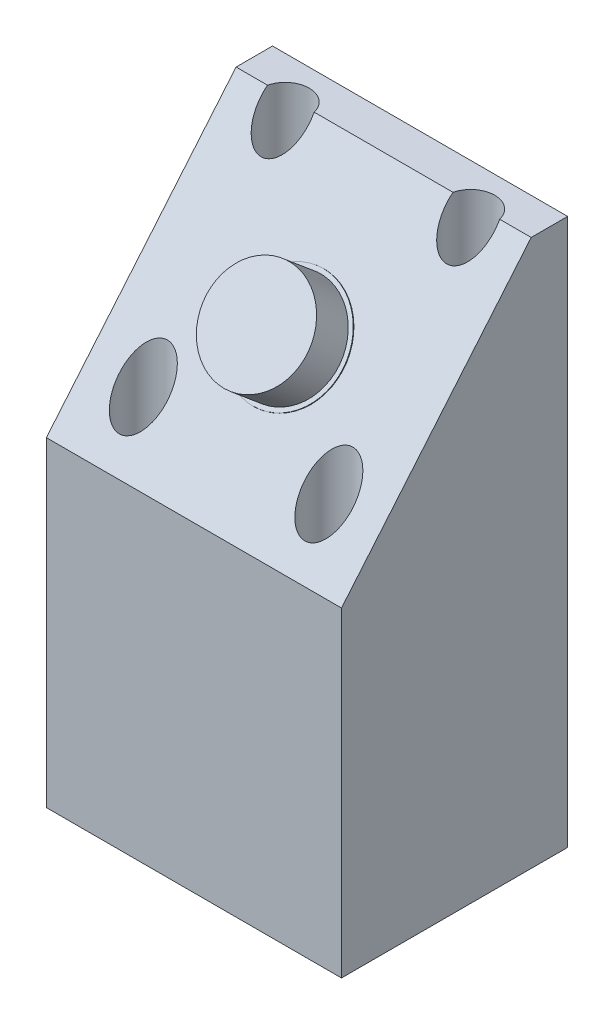
ISO-10303-21;
HEADER;
FILE_DESCRIPTION(('STEP AP214'),'2;1');
FILE_NAME('part.step','',(''),(''),'','','');
FILE_SCHEMA(('AUTOMOTIVE_DESIGN { 1 0 10303 214 1 1 1 1 }'));
ENDSEC;
DATA;
#1=APPLICATION_CONTEXT('core data for automotive mechanical design processes');
#2=APPLICATION_PROTOCOL_DEFINITION('international standard','automotive_design',2000,#1);
#3=PRODUCT_CONTEXT('',#1,'mechanical');
#4=PRODUCT('Part','Part','',(#3));
#5=PRODUCT_RELATED_PRODUCT_CATEGORY('part','',(#4));
#6=PRODUCT_DEFINITION_FORMATION('','',#4);
#7=PRODUCT_DEFINITION_CONTEXT('part definition',#1,'design');
#8=PRODUCT_DEFINITION('design','',#6,#7);
#9=PRODUCT_DEFINITION_SHAPE('','',#8);
#10=(LENGTH_UNIT() NAMED_UNIT(*) SI_UNIT(.MILLI.,.METRE.));
#11=(NAMED_UNIT(*) PLANE_ANGLE_UNIT() SI_UNIT($,.RADIAN.));
#12=(NAMED_UNIT(*) SI_UNIT($,.STERADIAN.) SOLID_ANGLE_UNIT());
#13=UNCERTAINTY_MEASURE_WITH_UNIT(LENGTH_MEASURE(1.E-05),#10,'distance_accuracy_value','');
#14=(GEOMETRIC_REPRESENTATION_CONTEXT(3) GLOBAL_UNCERTAINTY_ASSIGNED_CONTEXT((#13)) GLOBAL_UNIT_ASSIGNED_CONTEXT((#10,
#11,#12)) REPRESENTATION_CONTEXT('',''));
#15=CARTESIAN_POINT('',(0.,0.,0.));
#16=DIRECTION('',(0.,0.,1.));
#17=DIRECTION('',(1.,0.,0.));
#18=AXIS2_PLACEMENT_3D('',#15,#16,#17);
#19=CARTESIAN_POINT('',(35.,0.,0.));
#20=DIRECTION('',(0.,0.,-1.));
#21=DIRECTION('',(-1.,0.,0.));
#22=AXIS2_PLACEMENT_3D('',#19,#20,#21);
#23=PLANE('',#22);
#24=DIRECTION('',(0.,-1.,0.));
#25=VECTOR('',#24,1.);
#26=CARTESIAN_POINT('',(0.,0.,0.));
#27=LINE('',#26,#25);
#28=CARTESIAN_POINT('',(0.,38.,0.));
#29=VERTEX_POINT('',#28);
#30=CARTESIAN_POINT('',(0.,0.,0.));
#31=VERTEX_POINT('',#30);
#32=EDGE_CURVE('E137',#29,#31,#27,.T.);
#33=ORIENTED_EDGE('',*,*,#32,.T.);
#34=DIRECTION('',(-1.,0.,0.));
#35=VECTOR('',#34,1.);
#36=CARTESIAN_POINT('',(35.,0.,0.));
#37=LINE('',#36,#35);
#38=CARTESIAN_POINT('',(35.,0.,0.));
#39=VERTEX_POINT('',#38);
#40=EDGE_CURVE('E217',#39,#31,#37,.T.);
#41=ORIENTED_EDGE('',*,*,#40,.F.);
#42=DIRECTION('',(0.,-1.,0.));
#43=VECTOR('',#42,1.);
#44=CARTESIAN_POINT('',(35.,0.,0.));
#45=LINE('',#44,#43);
#46=CARTESIAN_POINT('',(35.,38.,0.));
#47=VERTEX_POINT('',#46);
#48=EDGE_CURVE('E130',#47,#39,#45,.T.);
#49=ORIENTED_EDGE('',*,*,#48,.F.);
#50=DIRECTION('',(-1.,0.,0.));
#51=VECTOR('',#50,1.);
#52=CARTESIAN_POINT('',(35.,38.,0.));
#53=LINE('',#52,#51);
#54=EDGE_CURVE('E118',#47,#29,#53,.T.);
#55=ORIENTED_EDGE('',*,*,#54,.T.);
#56=EDGE_LOOP('',(#33,#41,#49,#55));
#57=FACE_BOUND('',#56,.T.);
#58=ADVANCED_FACE('F35',(#57),#23,.F.);
#59=CARTESIAN_POINT('',(35.,0.,-22.4975663390288));
#60=DIRECTION('',(0.,1.,0.));
#61=DIRECTION('',(0.,0.,1.));
#62=AXIS2_PLACEMENT_3D('',#59,#60,#61);
#63=PLANE('',#62);
#64=CARTESIAN_POINT('',(6.49999999999999,0.,-5.));
#65=DIRECTION('',(0.,1.,0.));
#66=DIRECTION('',(0.,0.,1.));
#67=AXIS2_PLACEMENT_3D('',#64,#65,#66);
#68=CIRCLE('',#67,1.7);
#69=CARTESIAN_POINT('',(6.49999999999999,0.,-3.30000000000001));
#70=VERTEX_POINT('',#69);
#71=EDGE_CURVE('E183',#70,#70,#68,.T.);
#72=ORIENTED_EDGE('',*,*,#71,.T.);
#73=EDGE_LOOP('',(#72));
#74=FACE_BOUND('',#73,.T.);
#75=CARTESIAN_POINT('',(6.49999999999999,0.,-21.82));
#76=DIRECTION('',(0.,1.,0.));
#77=DIRECTION('',(0.,0.,1.));
#78=AXIS2_PLACEMENT_3D('',#75,#76,#77);
#79=CIRCLE('',#78,1.7);
#80=CARTESIAN_POINT('',(6.49999999999999,0.,-20.12));
#81=VERTEX_POINT('',#80);
#82=EDGE_CURVE('E177',#81,#81,#79,.T.);
#83=ORIENTED_EDGE('',*,*,#82,.T.);
#84=EDGE_LOOP('',(#83));
#85=FACE_BOUND('',#84,.T.);
#86=CARTESIAN_POINT('',(28.5,0.,-21.82));
#87=DIRECTION('',(0.,1.,0.));
#88=DIRECTION('',(0.,0.,1.));
#89=AXIS2_PLACEMENT_3D('',#86,#87,#88);
#90=CIRCLE('',#89,1.7);
#91=CARTESIAN_POINT('',(28.5,0.,-20.12));
#92=VERTEX_POINT('',#91);
#93=EDGE_CURVE('E171',#92,#92,#90,.T.);
#94=ORIENTED_EDGE('',*,*,#93,.T.);
#95=EDGE_LOOP('',(#94));
#96=FACE_BOUND('',#95,.T.);
#97=CARTESIAN_POINT('',(28.5,0.,-5.));
#98=DIRECTION('',(0.,1.,0.));
#99=DIRECTION('',(0.,0.,1.));
#100=AXIS2_PLACEMENT_3D('',#97,#98,#99);
#101=CIRCLE('',#100,1.7);
#102=CARTESIAN_POINT('',(28.5,0.,-3.3));
#103=VERTEX_POINT('',#102);
#104=EDGE_CURVE('E158',#103,#103,#101,.T.);
#105=ORIENTED_EDGE('',*,*,#104,.T.);
#106=EDGE_LOOP('',(#105));
#107=FACE_BOUND('',#106,.T.);
#108=DIRECTION('',(0.,0.,-1.));
#109=VECTOR('',#108,1.);
#110=CARTESIAN_POINT('',(0.,0.,-22.4975663390288));
#111=LINE('',#110,#109);
#112=CARTESIAN_POINT('',(0.,0.,-26.82));
#113=VERTEX_POINT('',#112);
#114=EDGE_CURVE('E135',#31,#113,#111,.T.);
#115=ORIENTED_EDGE('',*,*,#114,.T.);
#116=DIRECTION('',(-1.,0.,0.));
#117=VECTOR('',#116,1.);
#118=CARTESIAN_POINT('',(35.,0.,-26.82));
#119=LINE('',#118,#117);
#120=CARTESIAN_POINT('',(35.,0.,-26.82));
#121=VERTEX_POINT('',#120);
#122=EDGE_CURVE('E115',#121,#113,#119,.T.);
#123=ORIENTED_EDGE('',*,*,#122,.F.);
#124=DIRECTION('',(0.,0.,-1.));
#125=VECTOR('',#124,1.);
#126=CARTESIAN_POINT('',(35.,0.,0.));
#127=LINE('',#126,#125);
#128=EDGE_CURVE('E143',#39,#121,#127,.T.);
#129=ORIENTED_EDGE('',*,*,#128,.F.);
#130=ORIENTED_EDGE('',*,*,#40,.T.);
#131=EDGE_LOOP('',(#115,#123,#129,#130));
#132=FACE_BOUND('',#131,.T.);
#133=ADVANCED_FACE('F239',(#74,#85,#96,#107,#132),#63,.F.);
#134=CARTESIAN_POINT('',(35.,0.,-26.82));
#135=DIRECTION('',(0.,0.,1.));
#136=DIRECTION('',(1.,0.,0.));
#137=AXIS2_PLACEMENT_3D('',#134,#135,#136);
#138=PLANE('',#137);
#139=DIRECTION('',(0.,1.,0.));
#140=VECTOR('',#139,1.);
#141=CARTESIAN_POINT('',(0.,0.,-26.82));
#142=LINE('',#141,#140);
#143=CARTESIAN_POINT('',(0.,64.8115555091643,-26.82));
#144=VERTEX_POINT('',#143);
#145=EDGE_CURVE('E133',#113,#144,#142,.T.);
#146=ORIENTED_EDGE('',*,*,#145,.T.);
#147=DIRECTION('',(-1.,0.,0.));
#148=VECTOR('',#147,1.);
#149=CARTESIAN_POINT('',(35.,64.8115555091643,-26.82));
#150=LINE('',#149,#148);
#151=CARTESIAN_POINT('',(35.,64.8115555091643,-26.82));
#152=VERTEX_POINT('',#151);
#153=EDGE_CURVE('E111',#152,#144,#150,.T.);
#154=ORIENTED_EDGE('',*,*,#153,.F.);
#155=DIRECTION('',(0.,1.,0.));
#156=VECTOR('',#155,1.);
#157=CARTESIAN_POINT('',(35.,0.,-26.82));
#158=LINE('',#157,#156);
#159=EDGE_CURVE('E141',#121,#152,#158,.T.);
#160=ORIENTED_EDGE('',*,*,#159,.F.);
#161=ORIENTED_EDGE('',*,*,#122,.T.);
#162=EDGE_LOOP('',(#146,#154,#160,#161));
#163=FACE_BOUND('',#162,.T.);
#164=ADVANCED_FACE('F230',(#163),#138,.F.);
#165=CARTESIAN_POINT('',(35.,64.8115555091643,-26.82));
#166=DIRECTION('',(0.,-1.,0.));
#167=DIRECTION('',(0.,0.,-1.));
#168=AXIS2_PLACEMENT_3D('',#165,#166,#167);
#169=PLANE('',#168);
#170=DIRECTION('',(-1.,0.,0.));
#171=VECTOR('',#170,1.);
#172=CARTESIAN_POINT('',(35.,64.8115555091643,-22.4975663390288));
#173=LINE('',#172,#171);
#174=CARTESIAN_POINT('',(3.73171463605806,64.8115555091643,-22.4975663390288));
#175=VERTEX_POINT('',#174);
#176=CARTESIAN_POINT('',(0.,64.8115555091643,-22.4975663390288));
#177=VERTEX_POINT('',#176);
#178=EDGE_CURVE('E113',#175,#177,#173,.T.);
#179=ORIENTED_EDGE('',*,*,#178,.F.);
#180=CARTESIAN_POINT('',(6.49999999999999,64.8115555091643,-21.82));
#181=DIRECTION('',(0.,-1.,0.));
#182=DIRECTION('',(0.,0.,-1.));
#183=AXIS2_PLACEMENT_3D('',#180,#181,#182);
#184=CIRCLE('',#183,2.85);
#185=CARTESIAN_POINT('',(9.26828536394192,64.8115555091643,-22.4975663390288));
#186=VERTEX_POINT('',#185);
#187=EDGE_CURVE('E49',#175,#186,#184,.T.);
#188=ORIENTED_EDGE('',*,*,#187,.T.);
#189=CARTESIAN_POINT('',(25.7317146360581,64.8115555091643,-22.4975663390288));
#190=VERTEX_POINT('',#189);
#191=EDGE_CURVE('E104',#190,#186,#173,.T.);
#192=ORIENTED_EDGE('',*,*,#191,.F.);
#193=CARTESIAN_POINT('',(28.5,64.8115555091643,-21.82));
#194=DIRECTION('',(0.,-1.,0.));
#195=DIRECTION('',(0.,0.,1.));
#196=AXIS2_PLACEMENT_3D('',#193,#194,#195);
#197=CIRCLE('',#196,2.85);
#198=CARTESIAN_POINT('',(31.2682853639419,64.8115555091643,-22.4975663390288));
#199=VERTEX_POINT('',#198);
#200=EDGE_CURVE('E55',#190,#199,#197,.T.);
#201=ORIENTED_EDGE('',*,*,#200,.T.);
#202=CARTESIAN_POINT('',(35.,64.8115555091643,-22.4975663390288));
#203=VERTEX_POINT('',#202);
#204=EDGE_CURVE('E102',#203,#199,#173,.T.);
#205=ORIENTED_EDGE('',*,*,#204,.F.);
#206=DIRECTION('',(0.,0.,1.));
#207=VECTOR('',#206,1.);
#208=CARTESIAN_POINT('',(35.,64.8115555091643,-26.82));
#209=LINE('',#208,#207);
#210=EDGE_CURVE('E125',#152,#203,#209,.T.);
#211=ORIENTED_EDGE('',*,*,#210,.F.);
#212=ORIENTED_EDGE('',*,*,#153,.T.);
#213=DIRECTION('',(0.,0.,1.));
#214=VECTOR('',#213,1.);
#215=CARTESIAN_POINT('',(0.,64.8115555091643,-26.82));
#216=LINE('',#215,#214);
#217=EDGE_CURVE('E131',#144,#177,#216,.T.);
#218=ORIENTED_EDGE('',*,*,#217,.T.);
#219=EDGE_LOOP('',(#179,#188,#192,#201,#205,#211,#212,#218));
#220=FACE_BOUND('',#219,.T.);
#221=ADVANCED_FACE('F100',(#220),#169,.F.);
#222=CARTESIAN_POINT('',(35.,38.,0.));
#223=DIRECTION('',(0.,-0.642787609686538,-0.766044443118979));
#224=DIRECTION('',(0.,0.766044443118979,-0.642787609686538));
#225=AXIS2_PLACEMENT_3D('',#222,#223,#224);
#226=PLANE('',#225);
#227=CARTESIAN_POINT('',(6.49999999999999,43.9587679629711,-5.));
#228=DIRECTION('',(0.,-0.642787609686538,-0.766044443118979));
#229=DIRECTION('',(0.,-0.766044443118979,0.642787609686538));
#230=AXIS2_PLACEMENT_3D('',#227,#228,#229);
#231=ELLIPSE('',#230,4.43381290655219,2.85);
#232=CARTESIAN_POINT('',(6.49999999999999,40.5622702240776,-2.15));
#233=VERTEX_POINT('',#232);
#234=EDGE_CURVE('E38',#233,#233,#231,.T.);
#235=ORIENTED_EDGE('',*,*,#234,.T.);
#236=EDGE_LOOP('',(#235));
#237=FACE_BOUND('',#236,.T.);
#238=CARTESIAN_POINT('',(28.5,43.9587679629711,-5.));
#239=DIRECTION('',(0.,-0.642787609686538,-0.766044443118979));
#240=DIRECTION('',(0.,-0.766044443118979,0.642787609686538));
#241=AXIS2_PLACEMENT_3D('',#238,#239,#240);
#242=ELLIPSE('',#241,4.43381290655218,2.85);
#243=CARTESIAN_POINT('',(28.5,40.5622702240776,-2.15000000000001));
#244=VERTEX_POINT('',#243);
#245=EDGE_CURVE('E153',#244,#244,#242,.T.);
#246=ORIENTED_EDGE('',*,*,#245,.T.);
#247=EDGE_LOOP('',(#246));
#248=FACE_BOUND('',#247,.T.);
#249=CARTESIAN_POINT('',(17.5,51.4057777545822,-11.2487831695144));
#250=DIRECTION('',(0.,-0.642787609686538,-0.766044443118979));
#251=DIRECTION('',(0.,0.766044443118979,-0.642787609686538));
#252=AXIS2_PLACEMENT_3D('',#249,#250,#251);
#253=CIRCLE('',#252,6.50000000000001);
#254=CARTESIAN_POINT('',(17.5,56.3850666348555,-15.4269026324769));
#255=VERTEX_POINT('',#254);
#256=EDGE_CURVE('E95',#255,#255,#253,.F.);
#257=ORIENTED_EDGE('',*,*,#256,.F.);
#258=EDGE_LOOP('',(#257));
#259=FACE_BOUND('',#258,.T.);
#260=ORIENTED_EDGE('',*,*,#191,.T.);
#261=CARTESIAN_POINT('',(6.49999999999999,64.0040633904058,-21.82));
#262=DIRECTION('',(0.,-0.642787609686538,-0.766044443118979));
#263=DIRECTION('',(0.,-0.766044443118979,0.642787609686538));
#264=AXIS2_PLACEMENT_3D('',#261,#262,#263);
#265=ELLIPSE('',#264,4.43381290655219,2.85);
#266=EDGE_CURVE('E11',#186,#175,#265,.T.);
#267=ORIENTED_EDGE('',*,*,#266,.T.);
#268=ORIENTED_EDGE('',*,*,#178,.T.);
#269=DIRECTION('',(0.,-0.766044443118979,0.642787609686538));
#270=VECTOR('',#269,1.);
#271=CARTESIAN_POINT('',(0.,38.,0.));
#272=LINE('',#271,#270);
#273=EDGE_CURVE('E128',#177,#29,#272,.T.);
#274=ORIENTED_EDGE('',*,*,#273,.T.);
#275=ORIENTED_EDGE('',*,*,#54,.F.);
#276=DIRECTION('',(0.,-0.766044443118979,0.642787609686538));
#277=VECTOR('',#276,1.);
#278=CARTESIAN_POINT('',(35.,38.,0.));
#279=LINE('',#278,#277);
#280=EDGE_CURVE('E110',#203,#47,#279,.T.);
#281=ORIENTED_EDGE('',*,*,#280,.F.);
#282=ORIENTED_EDGE('',*,*,#204,.T.);
#283=CARTESIAN_POINT('',(28.5,64.0040633904058,-21.82));
#284=DIRECTION('',(0.,-0.642787609686538,-0.766044443118979));
#285=DIRECTION('',(0.,-0.766044443118979,0.642787609686538));
#286=AXIS2_PLACEMENT_3D('',#283,#284,#285);
#287=ELLIPSE('',#286,4.43381290655218,2.85);
#288=EDGE_CURVE('E43',#199,#190,#287,.T.);
#289=ORIENTED_EDGE('',*,*,#288,.T.);
#290=EDGE_LOOP('',(#260,#267,#268,#274,#275,#281,#282,#289));
#291=FACE_BOUND('',#290,.T.);
#292=ADVANCED_FACE('F108',(#237,#248,#259,#291),#226,.F.);
#293=CARTESIAN_POINT('',(35.,0.,0.));
#294=DIRECTION('',(1.,0.,0.));
#295=DIRECTION('',(0.,0.,-1.));
#296=AXIS2_PLACEMENT_3D('',#293,#294,#295);
#297=PLANE('',#296);
#298=ORIENTED_EDGE('',*,*,#48,.T.);
#299=ORIENTED_EDGE('',*,*,#128,.T.);
#300=ORIENTED_EDGE('',*,*,#159,.T.);
#301=ORIENTED_EDGE('',*,*,#210,.T.);
#302=ORIENTED_EDGE('',*,*,#280,.T.);
#303=EDGE_LOOP('',(#298,#299,#300,#301,#302));
#304=FACE_BOUND('',#303,.T.);
#305=ADVANCED_FACE('F209',(#304),#297,.T.);
#306=CARTESIAN_POINT('',(0.,0.,0.));
#307=DIRECTION('',(1.,0.,0.));
#308=DIRECTION('',(0.,0.,-1.));
#309=AXIS2_PLACEMENT_3D('',#306,#307,#308);
#310=PLANE('',#309);
#311=ORIENTED_EDGE('',*,*,#32,.F.);
#312=ORIENTED_EDGE('',*,*,#273,.F.);
#313=ORIENTED_EDGE('',*,*,#217,.F.);
#314=ORIENTED_EDGE('',*,*,#145,.F.);
#315=ORIENTED_EDGE('',*,*,#114,.F.);
#316=EDGE_LOOP('',(#311,#312,#313,#314,#315));
#317=FACE_BOUND('',#316,.T.);
#318=ADVANCED_FACE('F235',(#317),#310,.F.);
#319=CARTESIAN_POINT('',(17.5,51.4700565155508,-11.1721787252025));
#320=DIRECTION('',(0.,-0.642787609686538,-0.766044443118979));
#321=DIRECTION('',(0.,0.766044443118979,-0.642787609686538));
#322=AXIS2_PLACEMENT_3D('',#319,#320,#321);
#323=CYLINDRICAL_SURFACE('',#322,6.50000000000001);
#324=CARTESIAN_POINT('',(17.5,51.4700565155508,-11.1721787252025));
#325=DIRECTION('',(0.,0.642787609686538,0.766044443118979));
#326=DIRECTION('',(0.,-0.766044443118979,0.642787609686538));
#327=AXIS2_PLACEMENT_3D('',#324,#325,#326);
#328=CIRCLE('',#327,6.50000000000001);
#329=CARTESIAN_POINT('',(17.5,46.4907676352774,-6.99405926224002));
#330=VERTEX_POINT('',#329);
#331=EDGE_CURVE('E150',#330,#330,#328,.T.);
#332=ORIENTED_EDGE('',*,*,#331,.F.);
#333=EDGE_LOOP('',(#332));
#334=FACE_BOUND('',#333,.T.);
#335=ORIENTED_EDGE('',*,*,#256,.T.);
#336=EDGE_LOOP('',(#335));
#337=FACE_BOUND('',#336,.T.);
#338=ADVANCED_FACE('F255',(#334,#337),#323,.T.);
#339=CARTESIAN_POINT('',(17.5,51.4700565155508,-11.1721787252025));
#340=DIRECTION('',(0.,0.642787609686538,0.766044443118979));
#341=DIRECTION('',(0.,-0.766044443118979,0.642787609686538));
#342=AXIS2_PLACEMENT_3D('',#339,#340,#341);
#343=PLANE('',#342);
#344=CARTESIAN_POINT('',(17.5,51.4700565155508,-11.1721787252025));
#345=DIRECTION('',(0.,0.642787609686538,0.766044443118979));
#346=DIRECTION('',(0.,-0.766044443118979,0.642787609686538));
#347=AXIS2_PLACEMENT_3D('',#344,#345,#346);
#348=CIRCLE('',#347,6.00000000000001);
#349=CARTESIAN_POINT('',(17.5,46.8737898568369,-7.31545306708328));
#350=VERTEX_POINT('',#349);
#351=EDGE_CURVE('E149',#350,#350,#348,.T.);
#352=ORIENTED_EDGE('',*,*,#351,.F.);
#353=EDGE_LOOP('',(#352));
#354=FACE_BOUND('',#353,.T.);
#355=ORIENTED_EDGE('',*,*,#331,.T.);
#356=EDGE_LOOP('',(#355));
#357=FACE_BOUND('',#356,.T.);
#358=ADVANCED_FACE('F266',(#354,#357),#343,.T.);
#359=CARTESIAN_POINT('',(17.5,54.6197158030148,-7.41856095391951));
#360=DIRECTION('',(0.,0.642787609686538,0.766044443118979));
#361=DIRECTION('',(0.,-0.766044443118979,0.642787609686538));
#362=AXIS2_PLACEMENT_3D('',#359,#360,#361);
#363=PLANE('',#362);
#364=CARTESIAN_POINT('',(17.5,54.6197158030148,-7.41856095391951));
#365=DIRECTION('',(0.,0.642787609686538,0.766044443118979));
#366=DIRECTION('',(0.,-0.766044443118979,0.642787609686538));
#367=AXIS2_PLACEMENT_3D('',#364,#365,#366);
#368=CIRCLE('',#367,6.00000000000001);
#369=CARTESIAN_POINT('',(17.5,50.023449144301,-3.56183529580028));
#370=VERTEX_POINT('',#369);
#371=EDGE_CURVE('E138',#370,#370,#368,.T.);
#372=ORIENTED_EDGE('',*,*,#371,.T.);
#373=EDGE_LOOP('',(#372));
#374=FACE_BOUND('',#373,.T.);
#375=ADVANCED_FACE('F262',(#374),#363,.T.);
#376=CARTESIAN_POINT('',(17.5,54.6197158030148,-7.41856095391951));
#377=DIRECTION('',(0.,-0.642787609686538,-0.766044443118979));
#378=DIRECTION('',(0.,0.766044443118979,-0.642787609686538));
#379=AXIS2_PLACEMENT_3D('',#376,#377,#378);
#380=CYLINDRICAL_SURFACE('',#379,6.00000000000001);
#381=ORIENTED_EDGE('',*,*,#351,.T.);
#382=EDGE_LOOP('',(#381));
#383=FACE_BOUND('',#382,.T.);
#384=ORIENTED_EDGE('',*,*,#371,.F.);
#385=EDGE_LOOP('',(#384));
#386=FACE_BOUND('',#385,.T.);
#387=ADVANCED_FACE('F258',(#383,#386),#380,.T.);
#388=CARTESIAN_POINT('',(28.5,64.8115555091643,-5.));
#389=DIRECTION('',(0.,-1.,0.));
#390=DIRECTION('',(0.,0.,-1.));
#391=AXIS2_PLACEMENT_3D('',#388,#389,#390);
#392=CYLINDRICAL_SURFACE('',#391,2.85);
#393=CARTESIAN_POINT('',(28.5,4.5,-5.));
#394=DIRECTION('',(0.,-1.,0.));
#395=DIRECTION('',(0.,0.,-1.));
#396=AXIS2_PLACEMENT_3D('',#393,#394,#395);
#397=CIRCLE('',#396,2.85);
#398=CARTESIAN_POINT('',(28.5,4.5,-7.85));
#399=VERTEX_POINT('',#398);
#400=EDGE_CURVE('E154',#399,#399,#397,.T.);
#401=ORIENTED_EDGE('',*,*,#400,.T.);
#402=EDGE_LOOP('',(#401));
#403=FACE_BOUND('',#402,.T.);
#404=ORIENTED_EDGE('',*,*,#245,.F.);
#405=EDGE_LOOP('',(#404));
#406=FACE_BOUND('',#405,.T.);
#407=ADVANCED_FACE('F261',(#403,#406),#392,.F.);
#408=CARTESIAN_POINT('',(28.5,4.5,-5.));
#409=DIRECTION('',(0.,-1.,0.));
#410=DIRECTION('',(0.,0.,-1.));
#411=AXIS2_PLACEMENT_3D('',#408,#409,#410);
#412=PLANE('',#411);
#413=CARTESIAN_POINT('',(28.5,4.5,-5.));
#414=DIRECTION('',(0.,1.,0.));
#415=DIRECTION('',(0.,0.,1.));
#416=AXIS2_PLACEMENT_3D('',#413,#414,#415);
#417=CIRCLE('',#416,1.7);
#418=CARTESIAN_POINT('',(28.5,4.5,-3.3));
#419=VERTEX_POINT('',#418);
#420=EDGE_CURVE('E168',#419,#419,#417,.T.);
#421=ORIENTED_EDGE('',*,*,#420,.F.);
#422=EDGE_LOOP('',(#421));
#423=FACE_BOUND('',#422,.T.);
#424=ORIENTED_EDGE('',*,*,#400,.F.);
#425=EDGE_LOOP('',(#424));
#426=FACE_BOUND('',#425,.T.);
#427=ADVANCED_FACE('F276',(#423,#426),#412,.F.);
#428=CARTESIAN_POINT('',(28.5,64.8115555091643,-21.82));
#429=DIRECTION('',(0.,-1.,0.));
#430=DIRECTION('',(0.,0.,-1.));
#431=AXIS2_PLACEMENT_3D('',#428,#429,#430);
#432=CYLINDRICAL_SURFACE('',#431,2.85);
#433=CARTESIAN_POINT('',(28.5,4.5,-21.82));
#434=DIRECTION('',(0.,-1.,0.));
#435=DIRECTION('',(0.,0.,1.));
#436=AXIS2_PLACEMENT_3D('',#433,#434,#435);
#437=CIRCLE('',#436,2.85);
#438=CARTESIAN_POINT('',(28.5,4.5,-18.97));
#439=VERTEX_POINT('',#438);
#440=EDGE_CURVE('E106',#439,#439,#437,.T.);
#441=ORIENTED_EDGE('',*,*,#440,.T.);
#442=EDGE_LOOP('',(#441));
#443=FACE_BOUND('',#442,.T.);
#444=ORIENTED_EDGE('',*,*,#200,.F.);
#445=ORIENTED_EDGE('',*,*,#288,.F.);
#446=EDGE_LOOP('',(#444,#445));
#447=FACE_BOUND('',#446,.T.);
#448=ADVANCED_FACE('F90',(#443,#447),#432,.F.);
#449=CARTESIAN_POINT('',(28.5,4.5,-21.82));
#450=DIRECTION('',(0.,1.,0.));
#451=DIRECTION('',(0.,0.,1.));
#452=AXIS2_PLACEMENT_3D('',#449,#450,#451);
#453=PLANE('',#452);
#454=CARTESIAN_POINT('',(28.5,4.5,-21.82));
#455=DIRECTION('',(0.,1.,0.));
#456=DIRECTION('',(0.,0.,1.));
#457=AXIS2_PLACEMENT_3D('',#454,#455,#456);
#458=CIRCLE('',#457,1.7);
#459=CARTESIAN_POINT('',(28.5,4.5,-20.12));
#460=VERTEX_POINT('',#459);
#461=EDGE_CURVE('E174',#460,#460,#458,.T.);
#462=ORIENTED_EDGE('',*,*,#461,.F.);
#463=EDGE_LOOP('',(#462));
#464=FACE_BOUND('',#463,.T.);
#465=ORIENTED_EDGE('',*,*,#440,.F.);
#466=EDGE_LOOP('',(#465));
#467=FACE_BOUND('',#466,.T.);
#468=ADVANCED_FACE('F283',(#464,#467),#453,.T.);
#469=CARTESIAN_POINT('',(6.49999999999999,64.8115555091643,-21.82));
#470=DIRECTION('',(0.,-1.,0.));
#471=DIRECTION('',(0.,0.,-1.));
#472=AXIS2_PLACEMENT_3D('',#469,#470,#471);
#473=CYLINDRICAL_SURFACE('',#472,2.85);
#474=CARTESIAN_POINT('',(6.49999999999999,4.5,-21.82));
#475=DIRECTION('',(0.,-1.,0.));
#476=DIRECTION('',(0.,0.,-1.));
#477=AXIS2_PLACEMENT_3D('',#474,#475,#476);
#478=CIRCLE('',#477,2.85);
#479=CARTESIAN_POINT('',(6.49999999999999,4.5,-24.67));
#480=VERTEX_POINT('',#479);
#481=EDGE_CURVE('E105',#480,#480,#478,.T.);
#482=ORIENTED_EDGE('',*,*,#481,.T.);
#483=EDGE_LOOP('',(#482));
#484=FACE_BOUND('',#483,.T.);
#485=ORIENTED_EDGE('',*,*,#187,.F.);
#486=ORIENTED_EDGE('',*,*,#266,.F.);
#487=EDGE_LOOP('',(#485,#486));
#488=FACE_BOUND('',#487,.T.);
#489=ADVANCED_FACE('F287',(#484,#488),#473,.F.);
#490=CARTESIAN_POINT('',(6.49999999999999,4.5,-21.82));
#491=DIRECTION('',(0.,-1.,0.));
#492=DIRECTION('',(0.,0.,-1.));
#493=AXIS2_PLACEMENT_3D('',#490,#491,#492);
#494=PLANE('',#493);
#495=CARTESIAN_POINT('',(6.49999999999999,4.5,-21.82));
#496=DIRECTION('',(0.,1.,0.));
#497=DIRECTION('',(0.,0.,1.));
#498=AXIS2_PLACEMENT_3D('',#495,#496,#497);
#499=CIRCLE('',#498,1.7);
#500=CARTESIAN_POINT('',(6.49999999999999,4.5,-20.12));
#501=VERTEX_POINT('',#500);
#502=EDGE_CURVE('E180',#501,#501,#499,.T.);
#503=ORIENTED_EDGE('',*,*,#502,.F.);
#504=EDGE_LOOP('',(#503));
#505=FACE_BOUND('',#504,.T.);
#506=ORIENTED_EDGE('',*,*,#481,.F.);
#507=EDGE_LOOP('',(#506));
#508=FACE_BOUND('',#507,.T.);
#509=ADVANCED_FACE('F202',(#505,#508),#494,.F.);
#510=CARTESIAN_POINT('',(6.49999999999999,64.8115555091643,-5.));
#511=DIRECTION('',(0.,-1.,0.));
#512=DIRECTION('',(0.,0.,-1.));
#513=AXIS2_PLACEMENT_3D('',#510,#511,#512);
#514=CYLINDRICAL_SURFACE('',#513,2.85);
#515=CARTESIAN_POINT('',(6.49999999999999,4.5,-5.));
#516=DIRECTION('',(0.,-1.,0.));
#517=DIRECTION('',(0.,0.,1.));
#518=AXIS2_PLACEMENT_3D('',#515,#516,#517);
#519=CIRCLE('',#518,2.85);
#520=CARTESIAN_POINT('',(6.49999999999999,4.5,-2.15));
#521=VERTEX_POINT('',#520);
#522=EDGE_CURVE('E163',#521,#521,#519,.T.);
#523=ORIENTED_EDGE('',*,*,#522,.T.);
#524=EDGE_LOOP('',(#523));
#525=FACE_BOUND('',#524,.T.);
#526=ORIENTED_EDGE('',*,*,#234,.F.);
#527=EDGE_LOOP('',(#526));
#528=FACE_BOUND('',#527,.T.);
#529=ADVANCED_FACE('F196',(#525,#528),#514,.F.);
#530=CARTESIAN_POINT('',(6.49999999999999,4.5,-5.));
#531=DIRECTION('',(0.,1.,0.));
#532=DIRECTION('',(0.,0.,1.));
#533=AXIS2_PLACEMENT_3D('',#530,#531,#532);
#534=PLANE('',#533);
#535=CARTESIAN_POINT('',(6.49999999999999,4.5,-5.));
#536=DIRECTION('',(0.,1.,0.));
#537=DIRECTION('',(0.,0.,1.));
#538=AXIS2_PLACEMENT_3D('',#535,#536,#537);
#539=CIRCLE('',#538,1.7);
#540=CARTESIAN_POINT('',(6.49999999999999,4.5,-3.30000000000001));
#541=VERTEX_POINT('',#540);
#542=EDGE_CURVE('E186',#541,#541,#539,.T.);
#543=ORIENTED_EDGE('',*,*,#542,.F.);
#544=EDGE_LOOP('',(#543));
#545=FACE_BOUND('',#544,.T.);
#546=ORIENTED_EDGE('',*,*,#522,.F.);
#547=EDGE_LOOP('',(#546));
#548=FACE_BOUND('',#547,.T.);
#549=ADVANCED_FACE('F192',(#545,#548),#534,.T.);
#550=CARTESIAN_POINT('',(28.5,4.5,-5.));
#551=DIRECTION('',(0.,1.,0.));
#552=DIRECTION('',(0.,0.,1.));
#553=AXIS2_PLACEMENT_3D('',#550,#551,#552);
#554=CYLINDRICAL_SURFACE('',#553,1.7);
#555=ORIENTED_EDGE('',*,*,#104,.F.);
#556=EDGE_LOOP('',(#555));
#557=FACE_BOUND('',#556,.T.);
#558=ORIENTED_EDGE('',*,*,#420,.T.);
#559=EDGE_LOOP('',(#558));
#560=FACE_BOUND('',#559,.T.);
#561=ADVANCED_FACE('F195',(#557,#560),#554,.F.);
#562=CARTESIAN_POINT('',(28.5,4.5,-21.82));
#563=DIRECTION('',(0.,1.,0.));
#564=DIRECTION('',(0.,0.,1.));
#565=AXIS2_PLACEMENT_3D('',#562,#563,#564);
#566=CYLINDRICAL_SURFACE('',#565,1.7);
#567=ORIENTED_EDGE('',*,*,#93,.F.);
#568=EDGE_LOOP('',(#567));
#569=FACE_BOUND('',#568,.T.);
#570=ORIENTED_EDGE('',*,*,#461,.T.);
#571=EDGE_LOOP('',(#570));
#572=FACE_BOUND('',#571,.T.);
#573=ADVANCED_FACE('F297',(#569,#572),#566,.F.);
#574=CARTESIAN_POINT('',(6.49999999999999,4.5,-21.82));
#575=DIRECTION('',(0.,1.,0.));
#576=DIRECTION('',(0.,0.,1.));
#577=AXIS2_PLACEMENT_3D('',#574,#575,#576);
#578=CYLINDRICAL_SURFACE('',#577,1.7);
#579=ORIENTED_EDGE('',*,*,#82,.F.);
#580=EDGE_LOOP('',(#579));
#581=FACE_BOUND('',#580,.T.);
#582=ORIENTED_EDGE('',*,*,#502,.T.);
#583=EDGE_LOOP('',(#582));
#584=FACE_BOUND('',#583,.T.);
#585=ADVANCED_FACE('F301',(#581,#584),#578,.F.);
#586=CARTESIAN_POINT('',(6.49999999999999,4.5,-5.));
#587=DIRECTION('',(0.,1.,0.));
#588=DIRECTION('',(0.,0.,1.));
#589=AXIS2_PLACEMENT_3D('',#586,#587,#588);
#590=CYLINDRICAL_SURFACE('',#589,1.7);
#591=ORIENTED_EDGE('',*,*,#71,.F.);
#592=EDGE_LOOP('',(#591));
#593=FACE_BOUND('',#592,.T.);
#594=ORIENTED_EDGE('',*,*,#542,.T.);
#595=EDGE_LOOP('',(#594));
#596=FACE_BOUND('',#595,.T.);
#597=ADVANCED_FACE('F190',(#593,#596),#590,.F.);
#598=CLOSED_SHELL('',(#58,#133,#164,#221,#292,#305,#318,#338,#358,#375,#387,#407,#427,#448,#468,
#489,#509,#529,#549,#561,#573,#585,#597));
#599=MANIFOLD_SOLID_BREP('B2',#598);
#600=ADVANCED_BREP_SHAPE_REPRESENTATION('',(#18,#599),#14);
#601=SHAPE_DEFINITION_REPRESENTATION(#9,#600);
ENDSEC;
END-ISO-10303-21;
